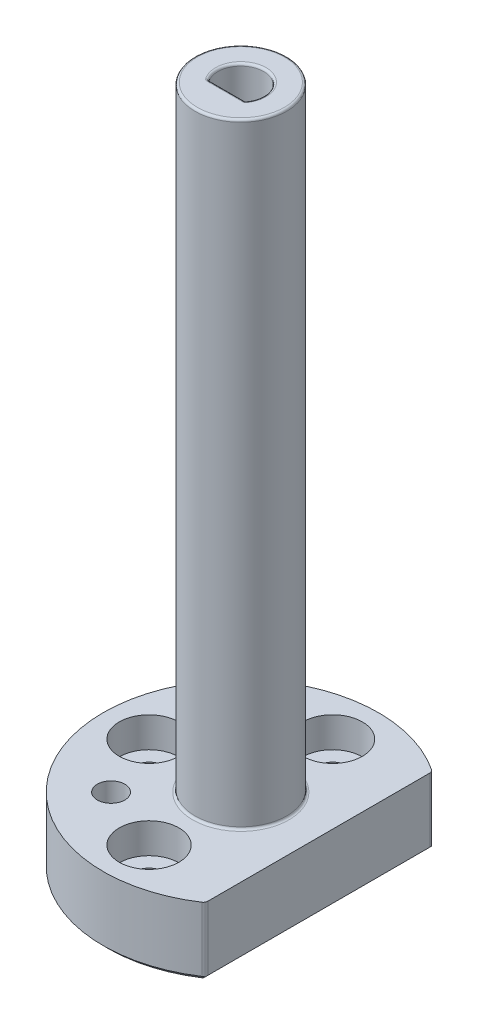
ISO-10303-21;
HEADER;
FILE_DESCRIPTION(('STEP AP214'),'2;1');
FILE_NAME('part.step','',(''),(''),'','','');
FILE_SCHEMA(('AUTOMOTIVE_DESIGN { 1 0 10303 214 1 1 1 1 }'));
ENDSEC;
DATA;
#1=APPLICATION_CONTEXT('core data for automotive mechanical design processes');
#2=APPLICATION_PROTOCOL_DEFINITION('international standard','automotive_design',2000,#1);
#3=PRODUCT_CONTEXT('',#1,'mechanical');
#4=PRODUCT('Part','Part','',(#3));
#5=PRODUCT_RELATED_PRODUCT_CATEGORY('part','',(#4));
#6=PRODUCT_DEFINITION_FORMATION('','',#4);
#7=PRODUCT_DEFINITION_CONTEXT('part definition',#1,'design');
#8=PRODUCT_DEFINITION('design','',#6,#7);
#9=PRODUCT_DEFINITION_SHAPE('','',#8);
#10=(LENGTH_UNIT() NAMED_UNIT(*) SI_UNIT(.MILLI.,.METRE.));
#11=(NAMED_UNIT(*) PLANE_ANGLE_UNIT() SI_UNIT($,.RADIAN.));
#12=(NAMED_UNIT(*) SI_UNIT($,.STERADIAN.) SOLID_ANGLE_UNIT());
#13=UNCERTAINTY_MEASURE_WITH_UNIT(LENGTH_MEASURE(1.E-05),#10,'distance_accuracy_value','');
#14=(GEOMETRIC_REPRESENTATION_CONTEXT(3) GLOBAL_UNCERTAINTY_ASSIGNED_CONTEXT((#13)) GLOBAL_UNIT_ASSIGNED_CONTEXT((#10,
#11,#12)) REPRESENTATION_CONTEXT('',''));
#15=CARTESIAN_POINT('',(0.,0.,0.));
#16=DIRECTION('',(0.,0.,1.));
#17=DIRECTION('',(1.,0.,0.));
#18=AXIS2_PLACEMENT_3D('',#15,#16,#17);
#19=CARTESIAN_POINT('',(0.,15.,0.));
#20=DIRECTION('',(0.,-1.,0.));
#21=DIRECTION('',(0.,0.,-1.));
#22=AXIS2_PLACEMENT_3D('',#19,#20,#21);
#23=CYLINDRICAL_SURFACE('',#22,30.);
#24=CARTESIAN_POINT('',(0.,15.,0.));
#25=DIRECTION('',(0.,1.,0.));
#26=DIRECTION('',(0.,0.,1.));
#27=AXIS2_PLACEMENT_3D('',#24,#25,#26);
#28=CIRCLE('',#27,30.);
#29=CARTESIAN_POINT('',(16.551724137931,15.,-25.0207999085127));
#30=VERTEX_POINT('',#29);
#31=CARTESIAN_POINT('',(16.551724137931,15.,25.0207999085127));
#32=VERTEX_POINT('',#31);
#33=EDGE_CURVE('E166',#30,#32,#28,.T.);
#34=ORIENTED_EDGE('',*,*,#33,.F.);
#35=DIRECTION('',(0.,-1.,0.));
#36=VECTOR('',#35,1.);
#37=CARTESIAN_POINT('',(16.551724137931,15.,-25.0207999085127));
#38=LINE('',#37,#36);
#39=CARTESIAN_POINT('',(16.551724137931,1.00000000000002,-25.0207999085127));
#40=VERTEX_POINT('',#39);
#41=EDGE_CURVE('E275',#30,#40,#38,.T.);
#42=ORIENTED_EDGE('',*,*,#41,.T.);
#43=CARTESIAN_POINT('',(0.,1.00000000000002,0.));
#44=DIRECTION('',(0.,1.,0.));
#45=DIRECTION('',(0.,0.,1.));
#46=AXIS2_PLACEMENT_3D('',#43,#44,#45);
#47=CIRCLE('',#46,30.);
#48=CARTESIAN_POINT('',(16.551724137931,1.00000000000002,25.0207999085127));
#49=VERTEX_POINT('',#48);
#50=EDGE_CURVE('E182',#40,#49,#47,.T.);
#51=ORIENTED_EDGE('',*,*,#50,.T.);
#52=DIRECTION('',(0.,-1.,0.));
#53=VECTOR('',#52,1.);
#54=CARTESIAN_POINT('',(16.551724137931,15.,25.0207999085127));
#55=LINE('',#54,#53);
#56=EDGE_CURVE('E281',#49,#32,#55,.F.);
#57=ORIENTED_EDGE('',*,*,#56,.T.);
#58=EDGE_LOOP('',(#34,#42,#51,#57));
#59=FACE_BOUND('',#58,.T.);
#60=ADVANCED_FACE('F38',(#59),#23,.T.);
#61=CARTESIAN_POINT('',(17.,15.,24.7184141886165));
#62=DIRECTION('',(-1.,0.,0.));
#63=DIRECTION('',(0.,0.,1.));
#64=AXIS2_PLACEMENT_3D('',#61,#62,#63);
#65=PLANE('',#64);
#66=DIRECTION('',(0.,0.,-1.));
#67=VECTOR('',#66,1.);
#68=CARTESIAN_POINT('',(17.,1.00000000000002,24.7184141886165));
#69=LINE('',#68,#67);
#70=CARTESIAN_POINT('',(17.,1.00000000000002,24.1867732448956));
#71=VERTEX_POINT('',#70);
#72=CARTESIAN_POINT('',(17.,1.00000000000002,-24.1867732448956));
#73=VERTEX_POINT('',#72);
#74=EDGE_CURVE('E175',#71,#73,#69,.T.);
#75=ORIENTED_EDGE('',*,*,#74,.T.);
#76=DIRECTION('',(0.,-1.,0.));
#77=VECTOR('',#76,1.);
#78=CARTESIAN_POINT('',(17.,15.,-24.1867732448956));
#79=LINE('',#78,#77);
#80=CARTESIAN_POINT('',(17.,15.,-24.1867732448956));
#81=VERTEX_POINT('',#80);
#82=EDGE_CURVE('E54',#73,#81,#79,.F.);
#83=ORIENTED_EDGE('',*,*,#82,.T.);
#84=DIRECTION('',(0.,0.,-1.));
#85=VECTOR('',#84,1.);
#86=CARTESIAN_POINT('',(17.,15.,24.7184141886165));
#87=LINE('',#86,#85);
#88=CARTESIAN_POINT('',(17.,15.,24.1867732448956));
#89=VERTEX_POINT('',#88);
#90=EDGE_CURVE('E169',#89,#81,#87,.T.);
#91=ORIENTED_EDGE('',*,*,#90,.F.);
#92=DIRECTION('',(0.,-1.,0.));
#93=VECTOR('',#92,1.);
#94=CARTESIAN_POINT('',(17.,15.,24.1867732448956));
#95=LINE('',#94,#93);
#96=EDGE_CURVE('E261',#89,#71,#95,.T.);
#97=ORIENTED_EDGE('',*,*,#96,.T.);
#98=EDGE_LOOP('',(#75,#83,#91,#97));
#99=FACE_BOUND('',#98,.T.);
#100=ADVANCED_FACE('F266',(#99),#65,.F.);
#101=CARTESIAN_POINT('',(0.,15.,0.));
#102=DIRECTION('',(0.,1.,0.));
#103=DIRECTION('',(0.,0.,1.));
#104=AXIS2_PLACEMENT_3D('',#101,#102,#103);
#105=PLANE('',#104);
#106=CARTESIAN_POINT('',(-14.142135623731,15.,14.1421356237309));
#107=DIRECTION('',(0.,1.,0.));
#108=DIRECTION('',(0.,0.,1.));
#109=AXIS2_PLACEMENT_3D('',#106,#107,#108);
#110=CIRCLE('',#109,3.);
#111=CARTESIAN_POINT('',(-14.142135623731,15.,17.1421356237309));
#112=VERTEX_POINT('',#111);
#113=EDGE_CURVE('E422',#112,#112,#110,.T.);
#114=ORIENTED_EDGE('',*,*,#113,.F.);
#115=EDGE_LOOP('',(#114));
#116=FACE_BOUND('',#115,.T.);
#117=CARTESIAN_POINT('',(0.,15.,0.));
#118=DIRECTION('',(0.,1.,0.));
#119=DIRECTION('',(0.,0.,1.));
#120=AXIS2_PLACEMENT_3D('',#117,#118,#119);
#121=CIRCLE('',#120,10.5);
#122=CARTESIAN_POINT('',(0.,15.,10.5));
#123=VERTEX_POINT('',#122);
#124=EDGE_CURVE('E283',#123,#123,#121,.F.);
#125=ORIENTED_EDGE('',*,*,#124,.T.);
#126=EDGE_LOOP('',(#125));
#127=FACE_BOUND('',#126,.T.);
#128=CARTESIAN_POINT('',(0.,15.,20.));
#129=DIRECTION('',(0.,1.,0.));
#130=DIRECTION('',(0.,0.,1.));
#131=AXIS2_PLACEMENT_3D('',#128,#129,#130);
#132=CIRCLE('',#131,6.5);
#133=CARTESIAN_POINT('',(0.,15.,26.5));
#134=VERTEX_POINT('',#133);
#135=EDGE_CURVE('E448',#134,#134,#132,.T.);
#136=ORIENTED_EDGE('',*,*,#135,.F.);
#137=EDGE_LOOP('',(#136));
#138=FACE_BOUND('',#137,.T.);
#139=CARTESIAN_POINT('',(-20.,15.,0.));
#140=DIRECTION('',(0.,1.,0.));
#141=DIRECTION('',(0.,0.,1.));
#142=AXIS2_PLACEMENT_3D('',#139,#140,#141);
#143=CIRCLE('',#142,6.5);
#144=CARTESIAN_POINT('',(-20.,15.,6.5));
#145=VERTEX_POINT('',#144);
#146=EDGE_CURVE('E454',#145,#145,#143,.T.);
#147=ORIENTED_EDGE('',*,*,#146,.F.);
#148=EDGE_LOOP('',(#147));
#149=FACE_BOUND('',#148,.T.);
#150=CARTESIAN_POINT('',(0.,15.,-20.));
#151=DIRECTION('',(0.,1.,0.));
#152=DIRECTION('',(0.,0.,-1.));
#153=AXIS2_PLACEMENT_3D('',#150,#151,#152);
#154=CIRCLE('',#153,6.5);
#155=CARTESIAN_POINT('',(0.,15.,-26.5));
#156=VERTEX_POINT('',#155);
#157=EDGE_CURVE('E430',#156,#156,#154,.T.);
#158=ORIENTED_EDGE('',*,*,#157,.F.);
#159=EDGE_LOOP('',(#158));
#160=FACE_BOUND('',#159,.T.);
#161=ORIENTED_EDGE('',*,*,#90,.T.);
#162=CARTESIAN_POINT('',(16.,15.,-24.1867732448956));
#163=DIRECTION('',(0.,1.,0.));
#164=DIRECTION('',(0.,0.,1.));
#165=AXIS2_PLACEMENT_3D('',#162,#163,#164);
#166=CIRCLE('',#165,1.);
#167=EDGE_CURVE('E11',#81,#30,#166,.T.);
#168=ORIENTED_EDGE('',*,*,#167,.T.);
#169=ORIENTED_EDGE('',*,*,#33,.T.);
#170=CARTESIAN_POINT('',(16.,15.,24.1867732448956));
#171=DIRECTION('',(0.,1.,0.));
#172=DIRECTION('',(0.,0.,1.));
#173=AXIS2_PLACEMENT_3D('',#170,#171,#172);
#174=CIRCLE('',#173,1.);
#175=EDGE_CURVE('E47',#32,#89,#174,.T.);
#176=ORIENTED_EDGE('',*,*,#175,.T.);
#177=EDGE_LOOP('',(#161,#168,#169,#176));
#178=FACE_BOUND('',#177,.T.);
#179=ADVANCED_FACE('F277',(#116,#127,#138,#149,#160,#178),#105,.T.);
#180=CARTESIAN_POINT('',(0.,0.,0.));
#181=DIRECTION('',(0.,1.,0.));
#182=DIRECTION('',(0.,0.,1.));
#183=AXIS2_PLACEMENT_3D('',#180,#181,#182);
#184=PLANE('',#183);
#185=CARTESIAN_POINT('',(-14.142135623731,0.,14.1421356237309));
#186=DIRECTION('',(0.,1.,0.));
#187=DIRECTION('',(0.,0.,1.));
#188=AXIS2_PLACEMENT_3D('',#185,#186,#187);
#189=CIRCLE('',#188,3.);
#190=CARTESIAN_POINT('',(-14.142135623731,0.,17.1421356237309));
#191=VERTEX_POINT('',#190);
#192=EDGE_CURVE('E301',#191,#191,#189,.T.);
#193=ORIENTED_EDGE('',*,*,#192,.T.);
#194=EDGE_LOOP('',(#193));
#195=FACE_BOUND('',#194,.T.);
#196=CARTESIAN_POINT('',(0.,0.,0.));
#197=DIRECTION('',(0.,1.,0.));
#198=DIRECTION('',(0.,0.,1.));
#199=AXIS2_PLACEMENT_3D('',#196,#197,#198);
#200=CIRCLE('',#199,29.);
#201=CARTESIAN_POINT('',(16.,0.,24.1867732448956));
#202=VERTEX_POINT('',#201);
#203=CARTESIAN_POINT('',(16.,0.,-24.1867732448956));
#204=VERTEX_POINT('',#203);
#205=EDGE_CURVE('E177',#202,#204,#200,.F.);
#206=ORIENTED_EDGE('',*,*,#205,.T.);
#207=DIRECTION('',(0.,0.,1.));
#208=VECTOR('',#207,1.);
#209=CARTESIAN_POINT('',(16.,0.,0.));
#210=LINE('',#209,#208);
#211=EDGE_CURVE('E179',#204,#202,#210,.T.);
#212=ORIENTED_EDGE('',*,*,#211,.T.);
#213=EDGE_LOOP('',(#206,#212));
#214=FACE_BOUND('',#213,.T.);
#215=CARTESIAN_POINT('',(0.,0.,20.));
#216=DIRECTION('',(0.,1.,0.));
#217=DIRECTION('',(0.,0.,1.));
#218=AXIS2_PLACEMENT_3D('',#215,#216,#217);
#219=CIRCLE('',#218,3.2);
#220=CARTESIAN_POINT('',(0.,0.,23.2));
#221=VERTEX_POINT('',#220);
#222=EDGE_CURVE('E427',#221,#221,#219,.T.);
#223=ORIENTED_EDGE('',*,*,#222,.T.);
#224=EDGE_LOOP('',(#223));
#225=FACE_BOUND('',#224,.T.);
#226=CARTESIAN_POINT('',(-20.,0.,0.));
#227=DIRECTION('',(0.,1.,0.));
#228=DIRECTION('',(0.,0.,1.));
#229=AXIS2_PLACEMENT_3D('',#226,#227,#228);
#230=CIRCLE('',#229,3.2);
#231=CARTESIAN_POINT('',(-20.,0.,3.20000000000001));
#232=VERTEX_POINT('',#231);
#233=EDGE_CURVE('E434',#232,#232,#230,.T.);
#234=ORIENTED_EDGE('',*,*,#233,.T.);
#235=EDGE_LOOP('',(#234));
#236=FACE_BOUND('',#235,.T.);
#237=CARTESIAN_POINT('',(0.,0.,-20.));
#238=DIRECTION('',(0.,1.,0.));
#239=DIRECTION('',(0.,0.,-1.));
#240=AXIS2_PLACEMENT_3D('',#237,#238,#239);
#241=CIRCLE('',#240,3.2);
#242=CARTESIAN_POINT('',(0.,0.,-23.2));
#243=VERTEX_POINT('',#242);
#244=EDGE_CURVE('E440',#243,#243,#241,.T.);
#245=ORIENTED_EDGE('',*,*,#244,.T.);
#246=EDGE_LOOP('',(#245));
#247=FACE_BOUND('',#246,.T.);
#248=CARTESIAN_POINT('',(0.,0.,0.));
#249=DIRECTION('',(0.,-1.,0.));
#250=DIRECTION('',(0.,0.,-1.));
#251=AXIS2_PLACEMENT_3D('',#248,#249,#250);
#252=CIRCLE('',#251,7.25);
#253=CARTESIAN_POINT('',(0.,0.,-7.25));
#254=VERTEX_POINT('',#253);
#255=EDGE_CURVE('E155',#254,#254,#252,.T.);
#256=ORIENTED_EDGE('',*,*,#255,.F.);
#257=EDGE_LOOP('',(#256));
#258=FACE_BOUND('',#257,.T.);
#259=ADVANCED_FACE('F336',(#195,#214,#225,#236,#247,#258),#184,.F.);
#260=CARTESIAN_POINT('',(0.,149.,0.));
#261=DIRECTION('',(0.,-1.,0.));
#262=DIRECTION('',(0.,0.,-1.));
#263=AXIS2_PLACEMENT_3D('',#260,#261,#262);
#264=CYLINDRICAL_SURFACE('',#263,10.);
#265=CARTESIAN_POINT('',(0.,15.5,0.));
#266=DIRECTION('',(0.,1.,0.));
#267=DIRECTION('',(0.,0.,1.));
#268=AXIS2_PLACEMENT_3D('',#265,#266,#267);
#269=CIRCLE('',#268,10.);
#270=CARTESIAN_POINT('',(0.,15.5,10.));
#271=VERTEX_POINT('',#270);
#272=EDGE_CURVE('E286',#271,#271,#269,.T.);
#273=ORIENTED_EDGE('',*,*,#272,.T.);
#274=EDGE_LOOP('',(#273));
#275=FACE_BOUND('',#274,.T.);
#276=CARTESIAN_POINT('',(0.,148.5,0.));
#277=DIRECTION('',(0.,1.,0.));
#278=DIRECTION('',(0.,0.,1.));
#279=AXIS2_PLACEMENT_3D('',#276,#277,#278);
#280=CIRCLE('',#279,10.);
#281=CARTESIAN_POINT('',(0.,148.5,10.));
#282=VERTEX_POINT('',#281);
#283=EDGE_CURVE('E318',#282,#282,#280,.F.);
#284=ORIENTED_EDGE('',*,*,#283,.T.);
#285=EDGE_LOOP('',(#284));
#286=FACE_BOUND('',#285,.T.);
#287=ADVANCED_FACE('F327',(#275,#286),#264,.T.);
#288=CARTESIAN_POINT('',(0.,149.,0.));
#289=DIRECTION('',(0.,1.,0.));
#290=DIRECTION('',(0.,0.,1.));
#291=AXIS2_PLACEMENT_3D('',#288,#289,#290);
#292=PLANE('',#291);
#293=CARTESIAN_POINT('',(3.87298334620742,149.,2.75));
#294=DIRECTION('',(0.,1.,0.));
#295=DIRECTION('',(0.,0.,1.));
#296=AXIS2_PLACEMENT_3D('',#293,#294,#295);
#297=CIRCLE('',#296,0.75);
#298=CARTESIAN_POINT('',(4.48450703245069,149.,3.18421052631579));
#299=VERTEX_POINT('',#298);
#300=CARTESIAN_POINT('',(3.87298334620742,149.,3.5));
#301=VERTEX_POINT('',#300);
#302=EDGE_CURVE('E314',#299,#301,#297,.F.);
#303=ORIENTED_EDGE('',*,*,#302,.T.);
#304=DIRECTION('',(-1.,0.,0.));
#305=VECTOR('',#304,1.);
#306=CARTESIAN_POINT('',(-3.87298334620742,149.,3.5));
#307=LINE('',#306,#305);
#308=CARTESIAN_POINT('',(-3.87298334620742,149.,3.5));
#309=VERTEX_POINT('',#308);
#310=EDGE_CURVE('E309',#301,#309,#307,.T.);
#311=ORIENTED_EDGE('',*,*,#310,.T.);
#312=CARTESIAN_POINT('',(-3.87298334620742,149.,2.75));
#313=DIRECTION('',(0.,1.,0.));
#314=DIRECTION('',(0.,0.,1.));
#315=AXIS2_PLACEMENT_3D('',#312,#313,#314);
#316=CIRCLE('',#315,0.75);
#317=CARTESIAN_POINT('',(-4.48450703245069,149.,3.18421052631579));
#318=VERTEX_POINT('',#317);
#319=EDGE_CURVE('E311',#309,#318,#316,.F.);
#320=ORIENTED_EDGE('',*,*,#319,.T.);
#321=CARTESIAN_POINT('',(0.,149.,0.));
#322=DIRECTION('',(0.,1.,0.));
#323=DIRECTION('',(0.,0.,1.));
#324=AXIS2_PLACEMENT_3D('',#321,#322,#323);
#325=CIRCLE('',#324,5.5);
#326=EDGE_CURVE('E316',#318,#299,#325,.F.);
#327=ORIENTED_EDGE('',*,*,#326,.T.);
#328=EDGE_LOOP('',(#303,#311,#320,#327));
#329=FACE_BOUND('',#328,.T.);
#330=CARTESIAN_POINT('',(0.,149.,0.));
#331=DIRECTION('',(0.,1.,0.));
#332=DIRECTION('',(0.,0.,1.));
#333=AXIS2_PLACEMENT_3D('',#330,#331,#332);
#334=CIRCLE('',#333,9.5);
#335=CARTESIAN_POINT('',(0.,149.,9.5));
#336=VERTEX_POINT('',#335);
#337=EDGE_CURVE('E185',#336,#336,#334,.T.);
#338=ORIENTED_EDGE('',*,*,#337,.T.);
#339=EDGE_LOOP('',(#338));
#340=FACE_BOUND('',#339,.T.);
#341=ADVANCED_FACE('F323',(#329,#340),#292,.T.);
#342=CARTESIAN_POINT('',(0.,57.,0.));
#343=DIRECTION('',(0.,-1.,0.));
#344=DIRECTION('',(0.,0.,-1.));
#345=AXIS2_PLACEMENT_3D('',#342,#343,#344);
#346=CYLINDRICAL_SURFACE('',#345,7.25);
#347=CARTESIAN_POINT('',(0.,57.,0.));
#348=DIRECTION('',(0.,-1.,0.));
#349=DIRECTION('',(0.,0.,-1.));
#350=AXIS2_PLACEMENT_3D('',#347,#348,#349);
#351=CIRCLE('',#350,7.25);
#352=CARTESIAN_POINT('',(0.,57.,-7.25));
#353=VERTEX_POINT('',#352);
#354=EDGE_CURVE('E159',#353,#353,#351,.T.);
#355=ORIENTED_EDGE('',*,*,#354,.F.);
#356=EDGE_LOOP('',(#355));
#357=FACE_BOUND('',#356,.T.);
#358=ORIENTED_EDGE('',*,*,#255,.T.);
#359=EDGE_LOOP('',(#358));
#360=FACE_BOUND('',#359,.T.);
#361=ADVANCED_FACE('F326',(#357,#360),#346,.F.);
#362=CARTESIAN_POINT('',(0.,57.,0.));
#363=DIRECTION('',(0.,-1.,0.));
#364=DIRECTION('',(0.,0.,-1.));
#365=AXIS2_PLACEMENT_3D('',#362,#363,#364);
#366=PLANE('',#365);
#367=CARTESIAN_POINT('',(0.,57.,0.));
#368=DIRECTION('',(0.,-1.,0.));
#369=DIRECTION('',(0.,0.,-1.));
#370=AXIS2_PLACEMENT_3D('',#367,#368,#369);
#371=CIRCLE('',#370,5.);
#372=CARTESIAN_POINT('',(-4.07682457495518,57.,2.89473684210526));
#373=VERTEX_POINT('',#372);
#374=CARTESIAN_POINT('',(4.07682457495517,57.,2.89473684210526));
#375=VERTEX_POINT('',#374);
#376=EDGE_CURVE('E156',#373,#375,#371,.T.);
#377=ORIENTED_EDGE('',*,*,#376,.F.);
#378=CARTESIAN_POINT('',(-3.87298334620742,57.,2.75));
#379=DIRECTION('',(0.,-1.,0.));
#380=DIRECTION('',(0.,0.,-1.));
#381=AXIS2_PLACEMENT_3D('',#378,#379,#380);
#382=CIRCLE('',#381,0.25);
#383=CARTESIAN_POINT('',(-3.87298334620742,57.,3.));
#384=VERTEX_POINT('',#383);
#385=EDGE_CURVE('E150',#373,#384,#382,.F.);
#386=ORIENTED_EDGE('',*,*,#385,.T.);
#387=DIRECTION('',(-1.,0.,0.));
#388=VECTOR('',#387,1.);
#389=CARTESIAN_POINT('',(-4.,57.,3.));
#390=LINE('',#389,#388);
#391=CARTESIAN_POINT('',(3.87298334620742,57.,3.));
#392=VERTEX_POINT('',#391);
#393=EDGE_CURVE('E133',#392,#384,#390,.T.);
#394=ORIENTED_EDGE('',*,*,#393,.F.);
#395=CARTESIAN_POINT('',(3.87298334620742,57.,2.75));
#396=DIRECTION('',(0.,-1.,0.));
#397=DIRECTION('',(0.,0.,-1.));
#398=AXIS2_PLACEMENT_3D('',#395,#396,#397);
#399=CIRCLE('',#398,0.25);
#400=EDGE_CURVE('E143',#392,#375,#399,.F.);
#401=ORIENTED_EDGE('',*,*,#400,.T.);
#402=EDGE_LOOP('',(#377,#386,#394,#401));
#403=FACE_BOUND('',#402,.T.);
#404=ORIENTED_EDGE('',*,*,#354,.T.);
#405=EDGE_LOOP('',(#404));
#406=FACE_BOUND('',#405,.T.);
#407=ADVANCED_FACE('F152',(#403,#406),#366,.T.);
#408=CARTESIAN_POINT('',(0.,149.,0.));
#409=DIRECTION('',(0.,-1.,0.));
#410=DIRECTION('',(0.,0.,-1.));
#411=AXIS2_PLACEMENT_3D('',#408,#409,#410);
#412=CYLINDRICAL_SURFACE('',#411,5.);
#413=DIRECTION('',(0.,-1.,0.));
#414=VECTOR('',#413,1.);
#415=CARTESIAN_POINT('',(4.07682457495518,149.,2.89473684210526));
#416=LINE('',#415,#414);
#417=CARTESIAN_POINT('',(4.07682457495518,148.5,2.89473684210526));
#418=VERTEX_POINT('',#417);
#419=EDGE_CURVE('E146',#375,#418,#416,.F.);
#420=ORIENTED_EDGE('',*,*,#419,.T.);
#421=CARTESIAN_POINT('',(0.,148.5,0.));
#422=DIRECTION('',(0.,1.,0.));
#423=DIRECTION('',(0.,0.,1.));
#424=AXIS2_PLACEMENT_3D('',#421,#422,#423);
#425=CIRCLE('',#424,5.);
#426=CARTESIAN_POINT('',(-4.07682457495518,148.5,2.89473684210526));
#427=VERTEX_POINT('',#426);
#428=EDGE_CURVE('E291',#418,#427,#425,.T.);
#429=ORIENTED_EDGE('',*,*,#428,.T.);
#430=DIRECTION('',(0.,-1.,0.));
#431=VECTOR('',#430,1.);
#432=CARTESIAN_POINT('',(-4.07682457495518,149.,2.89473684210526));
#433=LINE('',#432,#431);
#434=EDGE_CURVE('E139',#427,#373,#433,.T.);
#435=ORIENTED_EDGE('',*,*,#434,.T.);
#436=ORIENTED_EDGE('',*,*,#376,.T.);
#437=EDGE_LOOP('',(#420,#429,#435,#436));
#438=FACE_BOUND('',#437,.T.);
#439=ADVANCED_FACE('F368',(#438),#412,.F.);
#440=CARTESIAN_POINT('',(-4.,149.,3.));
#441=DIRECTION('',(0.,0.,1.));
#442=DIRECTION('',(1.,0.,0.));
#443=AXIS2_PLACEMENT_3D('',#440,#441,#442);
#444=PLANE('',#443);
#445=DIRECTION('',(0.,1.,0.));
#446=VECTOR('',#445,1.);
#447=CARTESIAN_POINT('',(-3.87298334620742,149.,3.));
#448=LINE('',#447,#446);
#449=CARTESIAN_POINT('',(-3.87298334620742,148.5,3.));
#450=VERTEX_POINT('',#449);
#451=EDGE_CURVE('E140',#384,#450,#448,.T.);
#452=ORIENTED_EDGE('',*,*,#451,.T.);
#453=DIRECTION('',(-1.,0.,0.));
#454=VECTOR('',#453,1.);
#455=CARTESIAN_POINT('',(3.87298334620742,148.5,3.));
#456=LINE('',#455,#454);
#457=CARTESIAN_POINT('',(3.87298334620742,148.5,3.));
#458=VERTEX_POINT('',#457);
#459=EDGE_CURVE('E136',#450,#458,#456,.F.);
#460=ORIENTED_EDGE('',*,*,#459,.T.);
#461=DIRECTION('',(0.,1.,0.));
#462=VECTOR('',#461,1.);
#463=CARTESIAN_POINT('',(3.87298334620742,57.,3.));
#464=LINE('',#463,#462);
#465=EDGE_CURVE('E128',#458,#392,#464,.F.);
#466=ORIENTED_EDGE('',*,*,#465,.T.);
#467=ORIENTED_EDGE('',*,*,#393,.T.);
#468=EDGE_LOOP('',(#452,#460,#466,#467));
#469=FACE_BOUND('',#468,.T.);
#470=ADVANCED_FACE('F131',(#469),#444,.F.);
#471=CARTESIAN_POINT('',(0.,8.4,-20.));
#472=DIRECTION('',(0.,1.,0.));
#473=DIRECTION('',(0.,0.,1.));
#474=AXIS2_PLACEMENT_3D('',#471,#472,#473);
#475=CYLINDRICAL_SURFACE('',#474,6.5);
#476=CARTESIAN_POINT('',(0.,8.4,-20.));
#477=DIRECTION('',(0.,1.,0.));
#478=DIRECTION('',(0.,0.,-1.));
#479=AXIS2_PLACEMENT_3D('',#476,#477,#478);
#480=CIRCLE('',#479,6.5);
#481=CARTESIAN_POINT('',(0.,8.4,-26.5));
#482=VERTEX_POINT('',#481);
#483=EDGE_CURVE('E457',#482,#482,#480,.T.);
#484=ORIENTED_EDGE('',*,*,#483,.F.);
#485=EDGE_LOOP('',(#484));
#486=FACE_BOUND('',#485,.T.);
#487=ORIENTED_EDGE('',*,*,#157,.T.);
#488=EDGE_LOOP('',(#487));
#489=FACE_BOUND('',#488,.T.);
#490=ADVANCED_FACE('F375',(#486,#489),#475,.F.);
#491=CARTESIAN_POINT('',(0.,8.4,-20.));
#492=DIRECTION('',(0.,-1.,0.));
#493=DIRECTION('',(0.,0.,-1.));
#494=AXIS2_PLACEMENT_3D('',#491,#492,#493);
#495=PLANE('',#494);
#496=CARTESIAN_POINT('',(0.,8.4,-20.));
#497=DIRECTION('',(0.,1.,0.));
#498=DIRECTION('',(0.,0.,-1.));
#499=AXIS2_PLACEMENT_3D('',#496,#497,#498);
#500=CIRCLE('',#499,3.2);
#501=CARTESIAN_POINT('',(0.,8.4,-23.2));
#502=VERTEX_POINT('',#501);
#503=EDGE_CURVE('E443',#502,#502,#500,.T.);
#504=ORIENTED_EDGE('',*,*,#503,.F.);
#505=EDGE_LOOP('',(#504));
#506=FACE_BOUND('',#505,.T.);
#507=ORIENTED_EDGE('',*,*,#483,.T.);
#508=EDGE_LOOP('',(#507));
#509=FACE_BOUND('',#508,.T.);
#510=ADVANCED_FACE('F381',(#506,#509),#495,.F.);
#511=CARTESIAN_POINT('',(-20.,8.4,0.));
#512=DIRECTION('',(0.,1.,0.));
#513=DIRECTION('',(0.,0.,1.));
#514=AXIS2_PLACEMENT_3D('',#511,#512,#513);
#515=CYLINDRICAL_SURFACE('',#514,6.5);
#516=CARTESIAN_POINT('',(-20.,8.4,0.));
#517=DIRECTION('',(0.,1.,0.));
#518=DIRECTION('',(0.,0.,1.));
#519=AXIS2_PLACEMENT_3D('',#516,#517,#518);
#520=CIRCLE('',#519,6.5);
#521=CARTESIAN_POINT('',(-20.,8.4,6.5));
#522=VERTEX_POINT('',#521);
#523=EDGE_CURVE('E451',#522,#522,#520,.T.);
#524=ORIENTED_EDGE('',*,*,#523,.F.);
#525=EDGE_LOOP('',(#524));
#526=FACE_BOUND('',#525,.T.);
#527=ORIENTED_EDGE('',*,*,#146,.T.);
#528=EDGE_LOOP('',(#527));
#529=FACE_BOUND('',#528,.T.);
#530=ADVANCED_FACE('F385',(#526,#529),#515,.F.);
#531=CARTESIAN_POINT('',(-20.,8.4,0.));
#532=DIRECTION('',(0.,1.,0.));
#533=DIRECTION('',(0.,0.,1.));
#534=AXIS2_PLACEMENT_3D('',#531,#532,#533);
#535=PLANE('',#534);
#536=CARTESIAN_POINT('',(-20.,8.4,0.));
#537=DIRECTION('',(0.,1.,0.));
#538=DIRECTION('',(0.,0.,1.));
#539=AXIS2_PLACEMENT_3D('',#536,#537,#538);
#540=CIRCLE('',#539,3.2);
#541=CARTESIAN_POINT('',(-20.,8.4,3.20000000000001));
#542=VERTEX_POINT('',#541);
#543=EDGE_CURVE('E437',#542,#542,#540,.T.);
#544=ORIENTED_EDGE('',*,*,#543,.F.);
#545=EDGE_LOOP('',(#544));
#546=FACE_BOUND('',#545,.T.);
#547=ORIENTED_EDGE('',*,*,#523,.T.);
#548=EDGE_LOOP('',(#547));
#549=FACE_BOUND('',#548,.T.);
#550=ADVANCED_FACE('F389',(#546,#549),#535,.T.);
#551=CARTESIAN_POINT('',(0.,8.4,20.));
#552=DIRECTION('',(0.,1.,0.));
#553=DIRECTION('',(0.,0.,1.));
#554=AXIS2_PLACEMENT_3D('',#551,#552,#553);
#555=CYLINDRICAL_SURFACE('',#554,6.5);
#556=CARTESIAN_POINT('',(0.,8.4,20.));
#557=DIRECTION('',(0.,1.,0.));
#558=DIRECTION('',(0.,0.,1.));
#559=AXIS2_PLACEMENT_3D('',#556,#557,#558);
#560=CIRCLE('',#559,6.5);
#561=CARTESIAN_POINT('',(0.,8.4,26.5));
#562=VERTEX_POINT('',#561);
#563=EDGE_CURVE('E161',#562,#562,#560,.T.);
#564=ORIENTED_EDGE('',*,*,#563,.F.);
#565=EDGE_LOOP('',(#564));
#566=FACE_BOUND('',#565,.T.);
#567=ORIENTED_EDGE('',*,*,#135,.T.);
#568=EDGE_LOOP('',(#567));
#569=FACE_BOUND('',#568,.T.);
#570=ADVANCED_FACE('F393',(#566,#569),#555,.F.);
#571=CARTESIAN_POINT('',(0.,8.4,20.));
#572=DIRECTION('',(0.,1.,0.));
#573=DIRECTION('',(0.,0.,1.));
#574=AXIS2_PLACEMENT_3D('',#571,#572,#573);
#575=PLANE('',#574);
#576=CARTESIAN_POINT('',(0.,8.4,20.));
#577=DIRECTION('',(0.,1.,0.));
#578=DIRECTION('',(0.,0.,1.));
#579=AXIS2_PLACEMENT_3D('',#576,#577,#578);
#580=CIRCLE('',#579,3.2);
#581=CARTESIAN_POINT('',(0.,8.4,23.2));
#582=VERTEX_POINT('',#581);
#583=EDGE_CURVE('E431',#582,#582,#580,.T.);
#584=ORIENTED_EDGE('',*,*,#583,.F.);
#585=EDGE_LOOP('',(#584));
#586=FACE_BOUND('',#585,.T.);
#587=ORIENTED_EDGE('',*,*,#563,.T.);
#588=EDGE_LOOP('',(#587));
#589=FACE_BOUND('',#588,.T.);
#590=ADVANCED_FACE('F397',(#586,#589),#575,.T.);
#591=CARTESIAN_POINT('',(0.,0.,-20.));
#592=DIRECTION('',(0.,1.,0.));
#593=DIRECTION('',(0.,0.,1.));
#594=AXIS2_PLACEMENT_3D('',#591,#592,#593);
#595=CYLINDRICAL_SURFACE('',#594,3.2);
#596=ORIENTED_EDGE('',*,*,#244,.F.);
#597=EDGE_LOOP('',(#596));
#598=FACE_BOUND('',#597,.T.);
#599=ORIENTED_EDGE('',*,*,#503,.T.);
#600=EDGE_LOOP('',(#599));
#601=FACE_BOUND('',#600,.T.);
#602=ADVANCED_FACE('F401',(#598,#601),#595,.F.);
#603=CARTESIAN_POINT('',(-20.,0.,0.));
#604=DIRECTION('',(0.,1.,0.));
#605=DIRECTION('',(0.,0.,1.));
#606=AXIS2_PLACEMENT_3D('',#603,#604,#605);
#607=CYLINDRICAL_SURFACE('',#606,3.2);
#608=ORIENTED_EDGE('',*,*,#233,.F.);
#609=EDGE_LOOP('',(#608));
#610=FACE_BOUND('',#609,.T.);
#611=ORIENTED_EDGE('',*,*,#543,.T.);
#612=EDGE_LOOP('',(#611));
#613=FACE_BOUND('',#612,.T.);
#614=ADVANCED_FACE('F405',(#610,#613),#607,.F.);
#615=CARTESIAN_POINT('',(0.,0.,20.));
#616=DIRECTION('',(0.,1.,0.));
#617=DIRECTION('',(0.,0.,1.));
#618=AXIS2_PLACEMENT_3D('',#615,#616,#617);
#619=CYLINDRICAL_SURFACE('',#618,3.2);
#620=ORIENTED_EDGE('',*,*,#222,.F.);
#621=EDGE_LOOP('',(#620));
#622=FACE_BOUND('',#621,.T.);
#623=ORIENTED_EDGE('',*,*,#583,.T.);
#624=EDGE_LOOP('',(#623));
#625=FACE_BOUND('',#624,.T.);
#626=ADVANCED_FACE('F349',(#622,#625),#619,.F.);
#627=CARTESIAN_POINT('',(3.87298334620742,149.,2.75));
#628=DIRECTION('',(0.,-1.,0.));
#629=DIRECTION('',(0.,0.,-1.));
#630=AXIS2_PLACEMENT_3D('',#627,#628,#629);
#631=CYLINDRICAL_SURFACE('',#630,0.25);
#632=ORIENTED_EDGE('',*,*,#465,.F.);
#633=CARTESIAN_POINT('',(3.87298334620742,148.5,2.75));
#634=DIRECTION('',(0.,1.,0.));
#635=DIRECTION('',(0.,0.,1.));
#636=AXIS2_PLACEMENT_3D('',#633,#634,#635);
#637=CIRCLE('',#636,0.25);
#638=EDGE_CURVE('E304',#458,#418,#637,.T.);
#639=ORIENTED_EDGE('',*,*,#638,.T.);
#640=ORIENTED_EDGE('',*,*,#419,.F.);
#641=ORIENTED_EDGE('',*,*,#400,.F.);
#642=EDGE_LOOP('',(#632,#639,#640,#641));
#643=FACE_BOUND('',#642,.T.);
#644=ADVANCED_FACE('F144',(#643),#631,.F.);
#645=CARTESIAN_POINT('',(-3.87298334620742,149.,2.75));
#646=DIRECTION('',(0.,-1.,0.));
#647=DIRECTION('',(0.,0.,-1.));
#648=AXIS2_PLACEMENT_3D('',#645,#646,#647);
#649=CYLINDRICAL_SURFACE('',#648,0.25);
#650=ORIENTED_EDGE('',*,*,#434,.F.);
#651=CARTESIAN_POINT('',(-3.87298334620742,148.5,2.75));
#652=DIRECTION('',(0.,1.,0.));
#653=DIRECTION('',(0.,0.,1.));
#654=AXIS2_PLACEMENT_3D('',#651,#652,#653);
#655=CIRCLE('',#654,0.25);
#656=EDGE_CURVE('E306',#427,#450,#655,.T.);
#657=ORIENTED_EDGE('',*,*,#656,.T.);
#658=ORIENTED_EDGE('',*,*,#451,.F.);
#659=ORIENTED_EDGE('',*,*,#385,.F.);
#660=EDGE_LOOP('',(#650,#657,#658,#659));
#661=FACE_BOUND('',#660,.T.);
#662=ADVANCED_FACE('F348',(#661),#649,.F.);
#663=CARTESIAN_POINT('',(0.,1.00000000000002,0.));
#664=DIRECTION('',(0.,1.,0.));
#665=DIRECTION('',(0.,0.,1.));
#666=AXIS2_PLACEMENT_3D('',#663,#664,#665);
#667=CONICAL_SURFACE('',#666,30.,0.785398163397452);
#668=ORIENTED_EDGE('',*,*,#50,.F.);
#669=CARTESIAN_POINT('',(16.551724137931,1.00000000000002,-25.0207999085127));
#670=CARTESIAN_POINT('',(16.5705969281406,1.00000270556567,-25.00831867922));
#671=CARTESIAN_POINT('',(16.5890304579726,0.999257032956359,-24.9951995388815));
#672=CARTESIAN_POINT('',(16.6248845741786,0.99630133927446,-24.9678155086069));
#673=CARTESIAN_POINT('',(16.6423057830802,0.994092228735464,-24.9535513359429));
#674=CARTESIAN_POINT('',(16.6919559815535,0.985477887247624,-24.9100251392777));
#675=CARTESIAN_POINT('',(16.7226215704734,0.977080114403063,-24.8793278660914));
#676=CARTESIAN_POINT('',(16.7768649725227,0.956284224155319,-24.8176797973541));
#677=CARTESIAN_POINT('',(16.8008012254025,0.944232001856727,-24.7869194260257));
#678=CARTESIAN_POINT('',(16.8449083398513,0.916263086273057,-24.7231310822907));
#679=CARTESIAN_POINT('',(16.8649678296667,0.900255823033917,-24.6900653175191));
#680=CARTESIAN_POINT('',(16.8827266048024,0.88272660480246,-24.6566601899946));
#681=B_SPLINE_CURVE_WITH_KNOTS('',3,(#669,#670,#671,#672,#673,#674,#675,#676,#677,#678,#679,
#680),.UNSPECIFIED.,.F.,.F.,(4,2,2,2,2,4),(0.,0.0678269996040081,0.135611837645519,
0.267450273349956,0.389435133832793,0.514525462928492),.UNSPECIFIED.);
#682=CARTESIAN_POINT('',(16.8827266047935,0.882726604793484,-24.6566601899898));
#683=VERTEX_POINT('',#682);
#684=EDGE_CURVE('E244',#40,#683,#681,.T.);
#685=ORIENTED_EDGE('',*,*,#684,.T.);
#686=CARTESIAN_POINT('',(17.,1.00000000000002,-24.7184141886165));
#687=CARTESIAN_POINT('',(16.83310900514,0.833109005140018,-24.6306513121808));
#688=CARTESIAN_POINT('',(16.6663301788978,0.666330178897794,-24.5424664644159));
#689=CARTESIAN_POINT('',(16.3329968455401,0.332996845540079,-24.3652528166006));
#690=CARTESIAN_POINT('',(16.1664423384489,0.166442338448965,-24.2762240164585));
#691=CARTESIAN_POINT('',(16.,0.,-24.1867732448956));
#692=B_SPLINE_CURVE_WITH_KNOTS('',3,(#686,#687,#688,#689,#690,#691),.UNSPECIFIED.,.F.,.F.,(4,2,
4),(0.,0.755421928637912,1.51084393935461),.UNSPECIFIED.);
#693=EDGE_CURVE('E186',#204,#683,#692,.F.);
#694=ORIENTED_EDGE('',*,*,#693,.F.);
#695=ORIENTED_EDGE('',*,*,#205,.F.);
#696=CARTESIAN_POINT('',(16.,0.,24.1867732448956));
#697=CARTESIAN_POINT('',(16.1664423384489,0.166442338448964,24.2762240164585));
#698=CARTESIAN_POINT('',(16.3329968455401,0.332996845540079,24.3652528166006));
#699=CARTESIAN_POINT('',(16.6663301788978,0.666330178897793,24.5424664644159));
#700=CARTESIAN_POINT('',(16.83310900514,0.833109005140018,24.6306513121808));
#701=CARTESIAN_POINT('',(17.,1.00000000000002,24.7184141886165));
#702=B_SPLINE_CURVE_WITH_KNOTS('',3,(#696,#697,#698,#699,#700,#701),.UNSPECIFIED.,.F.,.F.,(4,2,
4),(0.,0.755422010716696,1.51084393935461),.UNSPECIFIED.);
#703=CARTESIAN_POINT('',(16.8827266048022,0.882726604802262,24.6566601899945));
#704=VERTEX_POINT('',#703);
#705=EDGE_CURVE('E195',#704,#202,#702,.F.);
#706=ORIENTED_EDGE('',*,*,#705,.F.);
#707=CARTESIAN_POINT('',(16.8827266048022,0.882726604802262,24.6566601899945));
#708=CARTESIAN_POINT('',(16.8634305115543,0.901800139899456,24.6929904059928));
#709=CARTESIAN_POINT('',(16.8413729290351,0.919069748660955,24.7289410156098));
#710=CARTESIAN_POINT('',(16.7925592846315,0.948760391775205,24.7979778457275));
#711=CARTESIAN_POINT('',(16.7659469117415,0.961300246302402,24.8311153136579));
#712=CARTESIAN_POINT('',(16.7101920621591,0.98057713007166,24.8918853509347));
#713=CARTESIAN_POINT('',(16.6814422349513,0.987709041342432,24.9197465421273));
#714=CARTESIAN_POINT('',(16.6352603272548,0.995008086911922,24.9593478585875));
#715=CARTESIAN_POINT('',(16.6191332913151,0.996875597297765,24.9723323075973));
#716=CARTESIAN_POINT('',(16.5860355950651,0.999372921068222,24.9973244403357));
#717=CARTESIAN_POINT('',(16.5690645159028,1.00000211353231,25.009331631154));
#718=CARTESIAN_POINT('',(16.551724137931,1.00000000000002,25.0207999085127));
#719=B_SPLINE_CURVE_WITH_KNOTS('',3,(#707,#708,#709,#710,#711,#712,#713,#714,#715,#716,#717,
#718),.UNSPECIFIED.,.F.,.F.,(4,2,2,2,2,4),(0.,0.136079301421907,0.2684671394616,
0.389879782751869,0.452177428220378,0.514506303182591),.UNSPECIFIED.);
#720=EDGE_CURVE('E252',#704,#49,#719,.T.);
#721=ORIENTED_EDGE('',*,*,#720,.T.);
#722=EDGE_LOOP('',(#668,#685,#694,#695,#706,#721));
#723=FACE_BOUND('',#722,.T.);
#724=ADVANCED_FACE('F203',(#723),#667,.T.);
#725=CARTESIAN_POINT('',(17.,1.00000000000002,24.7184141886165));
#726=DIRECTION('',(-0.707106781186545,0.70710678118655,0.));
#727=DIRECTION('',(0.,0.,-1.));
#728=AXIS2_PLACEMENT_3D('',#725,#726,#727);
#729=PLANE('',#728);
#730=ORIENTED_EDGE('',*,*,#693,.T.);
#731=CARTESIAN_POINT('',(16.,0.,-24.1867732448956));
#732=DIRECTION('',(-0.707106781186545,0.70710678118655,0.));
#733=DIRECTION('',(-0.70710678118655,-0.707106781186545,0.));
#734=AXIS2_PLACEMENT_3D('',#731,#732,#733);
#735=ELLIPSE('',#734,1.41421356237309,1.);
#736=EDGE_CURVE('E259',#683,#73,#735,.F.);
#737=ORIENTED_EDGE('',*,*,#736,.T.);
#738=ORIENTED_EDGE('',*,*,#74,.F.);
#739=CARTESIAN_POINT('',(16.,0.,24.1867732448956));
#740=DIRECTION('',(-0.707106781186545,0.70710678118655,0.));
#741=DIRECTION('',(-0.70710678118655,-0.707106781186545,0.));
#742=AXIS2_PLACEMENT_3D('',#739,#740,#741);
#743=ELLIPSE('',#742,1.41421356237309,1.);
#744=EDGE_CURVE('E251',#71,#704,#743,.F.);
#745=ORIENTED_EDGE('',*,*,#744,.T.);
#746=ORIENTED_EDGE('',*,*,#705,.T.);
#747=ORIENTED_EDGE('',*,*,#211,.F.);
#748=EDGE_LOOP('',(#730,#737,#738,#745,#746,#747));
#749=FACE_BOUND('',#748,.T.);
#750=ADVANCED_FACE('F207',(#749),#729,.F.);
#751=CARTESIAN_POINT('',(0.,148.5,0.));
#752=DIRECTION('',(0.,1.,0.));
#753=DIRECTION('',(0.,0.,1.));
#754=AXIS2_PLACEMENT_3D('',#751,#752,#753);
#755=TOROIDAL_SURFACE('',#754,9.5,0.5);
#756=ORIENTED_EDGE('',*,*,#283,.F.);
#757=EDGE_LOOP('',(#756));
#758=FACE_BOUND('',#757,.T.);
#759=ORIENTED_EDGE('',*,*,#337,.F.);
#760=EDGE_LOOP('',(#759));
#761=FACE_BOUND('',#760,.T.);
#762=ADVANCED_FACE('F213',(#758,#761),#755,.T.);
#763=CARTESIAN_POINT('',(3.87298334620742,148.5,2.75));
#764=DIRECTION('',(0.,1.,0.));
#765=DIRECTION('',(0.,0.,1.));
#766=AXIS2_PLACEMENT_3D('',#763,#764,#765);
#767=TOROIDAL_SURFACE('',#766,0.75,0.5);
#768=CARTESIAN_POINT('',(4.48450703245069,148.5,3.18421052631579));
#769=DIRECTION('',(0.578947368421052,0.,-0.815364914991035));
#770=DIRECTION('',(-0.815364914991035,0.,-0.578947368421052));
#771=AXIS2_PLACEMENT_3D('',#768,#769,#770);
#772=CIRCLE('',#771,0.5);
#773=EDGE_CURVE('E294',#418,#299,#772,.T.);
#774=ORIENTED_EDGE('',*,*,#773,.F.);
#775=ORIENTED_EDGE('',*,*,#638,.F.);
#776=CARTESIAN_POINT('',(3.87298334620742,148.5,3.5));
#777=DIRECTION('',(-1.,0.,0.));
#778=DIRECTION('',(0.,0.,1.));
#779=AXIS2_PLACEMENT_3D('',#776,#777,#778);
#780=CIRCLE('',#779,0.5);
#781=EDGE_CURVE('E196',#301,#458,#780,.T.);
#782=ORIENTED_EDGE('',*,*,#781,.F.);
#783=ORIENTED_EDGE('',*,*,#302,.F.);
#784=EDGE_LOOP('',(#774,#775,#782,#783));
#785=FACE_BOUND('',#784,.T.);
#786=ADVANCED_FACE('F218',(#785),#767,.T.);
#787=CARTESIAN_POINT('',(0.,148.5,3.5));
#788=DIRECTION('',(1.,0.,0.));
#789=DIRECTION('',(0.,0.,-1.));
#790=AXIS2_PLACEMENT_3D('',#787,#788,#789);
#791=CYLINDRICAL_SURFACE('',#790,0.5);
#792=ORIENTED_EDGE('',*,*,#781,.T.);
#793=ORIENTED_EDGE('',*,*,#459,.F.);
#794=CARTESIAN_POINT('',(-3.87298334620742,148.5,3.5));
#795=DIRECTION('',(-1.,0.,0.));
#796=DIRECTION('',(0.,0.,1.));
#797=AXIS2_PLACEMENT_3D('',#794,#795,#796);
#798=CIRCLE('',#797,0.5);
#799=EDGE_CURVE('E297',#309,#450,#798,.T.);
#800=ORIENTED_EDGE('',*,*,#799,.F.);
#801=ORIENTED_EDGE('',*,*,#310,.F.);
#802=EDGE_LOOP('',(#792,#793,#800,#801));
#803=FACE_BOUND('',#802,.T.);
#804=ADVANCED_FACE('F228',(#803),#791,.T.);
#805=CARTESIAN_POINT('',(0.,148.5,0.));
#806=DIRECTION('',(0.,1.,0.));
#807=DIRECTION('',(0.,0.,1.));
#808=AXIS2_PLACEMENT_3D('',#805,#806,#807);
#809=TOROIDAL_SURFACE('',#808,5.5,0.5);
#810=ORIENTED_EDGE('',*,*,#773,.T.);
#811=ORIENTED_EDGE('',*,*,#326,.F.);
#812=CARTESIAN_POINT('',(-4.48450703245069,148.5,3.18421052631579));
#813=DIRECTION('',(0.578947368421053,0.,0.815364914991035));
#814=DIRECTION('',(0.815364914991035,0.,-0.578947368421053));
#815=AXIS2_PLACEMENT_3D('',#812,#813,#814);
#816=CIRCLE('',#815,0.5);
#817=EDGE_CURVE('E299',#427,#318,#816,.T.);
#818=ORIENTED_EDGE('',*,*,#817,.F.);
#819=ORIENTED_EDGE('',*,*,#428,.F.);
#820=EDGE_LOOP('',(#810,#811,#818,#819));
#821=FACE_BOUND('',#820,.T.);
#822=ADVANCED_FACE('F224',(#821),#809,.T.);
#823=CARTESIAN_POINT('',(-3.87298334620742,148.5,2.75));
#824=DIRECTION('',(0.,1.,0.));
#825=DIRECTION('',(0.,0.,1.));
#826=AXIS2_PLACEMENT_3D('',#823,#824,#825);
#827=TOROIDAL_SURFACE('',#826,0.75,0.5);
#828=ORIENTED_EDGE('',*,*,#799,.T.);
#829=ORIENTED_EDGE('',*,*,#656,.F.);
#830=ORIENTED_EDGE('',*,*,#817,.T.);
#831=ORIENTED_EDGE('',*,*,#319,.F.);
#832=EDGE_LOOP('',(#828,#829,#830,#831));
#833=FACE_BOUND('',#832,.T.);
#834=ADVANCED_FACE('F220',(#833),#827,.T.);
#835=CARTESIAN_POINT('',(0.,15.5,0.));
#836=DIRECTION('',(0.,1.,0.));
#837=DIRECTION('',(0.,0.,1.));
#838=AXIS2_PLACEMENT_3D('',#835,#836,#837);
#839=TOROIDAL_SURFACE('',#838,10.5,0.5);
#840=ORIENTED_EDGE('',*,*,#124,.F.);
#841=EDGE_LOOP('',(#840));
#842=FACE_BOUND('',#841,.T.);
#843=ORIENTED_EDGE('',*,*,#272,.F.);
#844=EDGE_LOOP('',(#843));
#845=FACE_BOUND('',#844,.T.);
#846=ADVANCED_FACE('F223',(#842,#845),#839,.F.);
#847=CARTESIAN_POINT('',(-14.142135623731,0.,14.1421356237309));
#848=DIRECTION('',(0.,1.,0.));
#849=DIRECTION('',(0.,0.,1.));
#850=AXIS2_PLACEMENT_3D('',#847,#848,#849);
#851=CYLINDRICAL_SURFACE('',#850,3.);
#852=ORIENTED_EDGE('',*,*,#192,.F.);
#853=EDGE_LOOP('',(#852));
#854=FACE_BOUND('',#853,.T.);
#855=ORIENTED_EDGE('',*,*,#113,.T.);
#856=EDGE_LOOP('',(#855));
#857=FACE_BOUND('',#856,.T.);
#858=ADVANCED_FACE('F237',(#854,#857),#851,.F.);
#859=CARTESIAN_POINT('',(16.,15.,-24.1867732448956));
#860=DIRECTION('',(0.,-1.,0.));
#861=DIRECTION('',(0.,0.,-1.));
#862=AXIS2_PLACEMENT_3D('',#859,#860,#861);
#863=CYLINDRICAL_SURFACE('',#862,1.);
#864=ORIENTED_EDGE('',*,*,#167,.F.);
#865=ORIENTED_EDGE('',*,*,#82,.F.);
#866=ORIENTED_EDGE('',*,*,#736,.F.);
#867=ORIENTED_EDGE('',*,*,#684,.F.);
#868=ORIENTED_EDGE('',*,*,#41,.F.);
#869=EDGE_LOOP('',(#864,#865,#866,#867,#868));
#870=FACE_BOUND('',#869,.T.);
#871=ADVANCED_FACE('F239',(#870),#863,.T.);
#872=CARTESIAN_POINT('',(16.,15.,24.1867732448956));
#873=DIRECTION('',(0.,-1.,0.));
#874=DIRECTION('',(0.,0.,-1.));
#875=AXIS2_PLACEMENT_3D('',#872,#873,#874);
#876=CYLINDRICAL_SURFACE('',#875,1.);
#877=ORIENTED_EDGE('',*,*,#175,.F.);
#878=ORIENTED_EDGE('',*,*,#56,.F.);
#879=ORIENTED_EDGE('',*,*,#720,.F.);
#880=ORIENTED_EDGE('',*,*,#744,.F.);
#881=ORIENTED_EDGE('',*,*,#96,.F.);
#882=EDGE_LOOP('',(#877,#878,#879,#880,#881));
#883=FACE_BOUND('',#882,.T.);
#884=ADVANCED_FACE('F40',(#883),#876,.T.);
#885=CLOSED_SHELL('',(#60,#100,#179,#259,#287,#341,#361,#407,#439,#470,#490,#510,#530,#550,#570,
#590,#602,#614,#626,#644,#662,#724,#750,#762,#786,#804,#822,#834,#846,#858,#871,#884));
#886=MANIFOLD_SOLID_BREP('B2',#885);
#887=ADVANCED_BREP_SHAPE_REPRESENTATION('',(#18,#886),#14);
#888=SHAPE_DEFINITION_REPRESENTATION(#9,#887);
ENDSEC;
END-ISO-10303-21;
